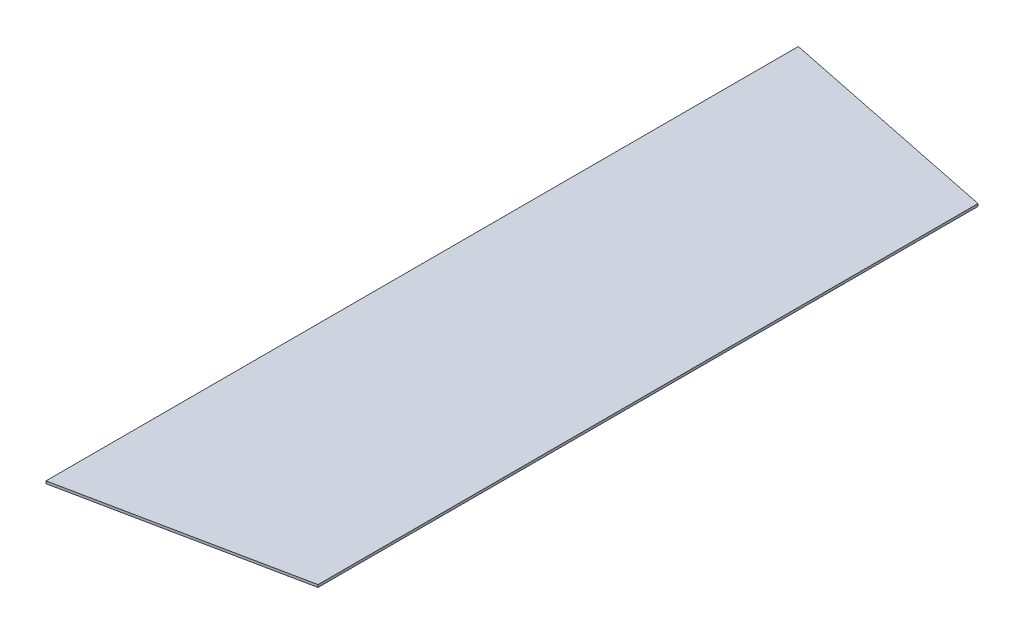
ISO-10303-21;
HEADER;
FILE_DESCRIPTION(('STEP AP214'),'2;1');
FILE_NAME('part.step','',(''),(''),'','','');
FILE_SCHEMA(('AUTOMOTIVE_DESIGN { 1 0 10303 214 1 1 1 1 }'));
ENDSEC;
DATA;
#1=APPLICATION_CONTEXT('core data for automotive mechanical design processes');
#2=APPLICATION_PROTOCOL_DEFINITION('international standard','automotive_design',2000,#1);
#3=PRODUCT_CONTEXT('',#1,'mechanical');
#4=PRODUCT('Part','Part','',(#3));
#5=PRODUCT_RELATED_PRODUCT_CATEGORY('part','',(#4));
#6=PRODUCT_DEFINITION_FORMATION('','',#4);
#7=PRODUCT_DEFINITION_CONTEXT('part definition',#1,'design');
#8=PRODUCT_DEFINITION('design','',#6,#7);
#9=PRODUCT_DEFINITION_SHAPE('','',#8);
#10=(LENGTH_UNIT() NAMED_UNIT(*) SI_UNIT(.MILLI.,.METRE.));
#11=(NAMED_UNIT(*) PLANE_ANGLE_UNIT() SI_UNIT($,.RADIAN.));
#12=(NAMED_UNIT(*) SI_UNIT($,.STERADIAN.) SOLID_ANGLE_UNIT());
#13=UNCERTAINTY_MEASURE_WITH_UNIT(LENGTH_MEASURE(1.E-05),#10,'distance_accuracy_value','');
#14=(GEOMETRIC_REPRESENTATION_CONTEXT(3) GLOBAL_UNCERTAINTY_ASSIGNED_CONTEXT((#13)) GLOBAL_UNIT_ASSIGNED_CONTEXT((#10,
#11,#12)) REPRESENTATION_CONTEXT('',''));
#15=CARTESIAN_POINT('',(0.,0.,0.));
#16=DIRECTION('',(0.,0.,1.));
#17=DIRECTION('',(1.,0.,0.));
#18=AXIS2_PLACEMENT_3D('',#15,#16,#17);
#19=CARTESIAN_POINT('',(0.600000000000001,0.,-1.49897790055249));
#20=DIRECTION('',(0.,1.,0.));
#21=DIRECTION('',(0.,0.,1.));
#22=AXIS2_PLACEMENT_3D('',#19,#20,#21);
#23=PLANE('',#22);
#24=DIRECTION('',(-0.979739078021312,0.,-0.200278154070655));
#25=VECTOR('',#24,1.);
#26=CARTESIAN_POINT('',(1.5,0.,-1.315));
#27=LINE('',#26,#25);
#28=CARTESIAN_POINT('',(1.5,0.,-1.315));
#29=VERTEX_POINT('',#28);
#30=CARTESIAN_POINT('',(0.600000000000001,0.,-1.49897790055249));
#31=VERTEX_POINT('',#30);
#32=EDGE_CURVE('E11',#29,#31,#27,.T.);
#33=ORIENTED_EDGE('',*,*,#32,.T.);
#34=DIRECTION('',(0.,0.,-1.));
#35=VECTOR('',#34,1.);
#36=CARTESIAN_POINT('',(0.600000000000001,0.,1.49897790055249));
#37=LINE('',#36,#35);
#38=CARTESIAN_POINT('',(0.600000000000001,0.,1.49897790055249));
#39=VERTEX_POINT('',#38);
#40=EDGE_CURVE('E61',#39,#31,#37,.T.);
#41=ORIENTED_EDGE('',*,*,#40,.F.);
#42=DIRECTION('',(0.979739078021312,0.,-0.200278154070655));
#43=VECTOR('',#42,1.);
#44=CARTESIAN_POINT('',(0.6,0.,1.49897790055249));
#45=LINE('',#44,#43);
#46=CARTESIAN_POINT('',(1.5,0.,1.315));
#47=VERTEX_POINT('',#46);
#48=EDGE_CURVE('E85',#39,#47,#45,.T.);
#49=ORIENTED_EDGE('',*,*,#48,.T.);
#50=DIRECTION('',(0.,0.,-1.));
#51=VECTOR('',#50,1.);
#52=CARTESIAN_POINT('',(1.5,0.,1.315));
#53=LINE('',#52,#51);
#54=EDGE_CURVE('E24',#47,#29,#53,.T.);
#55=ORIENTED_EDGE('',*,*,#54,.T.);
#56=EDGE_LOOP('',(#33,#41,#49,#55));
#57=FACE_BOUND('',#56,.T.);
#58=ADVANCED_FACE('F17',(#57),#23,.T.);
#59=CARTESIAN_POINT('',(1.5,0.29,1.315));
#60=DIRECTION('',(-1.,0.,0.));
#61=DIRECTION('',(0.,0.,1.));
#62=AXIS2_PLACEMENT_3D('',#59,#60,#61);
#63=PLANE('',#62);
#64=ORIENTED_EDGE('',*,*,#54,.F.);
#65=DIRECTION('',(0.,-1.,0.));
#66=VECTOR('',#65,1.);
#67=CARTESIAN_POINT('',(1.5,0.,1.315));
#68=LINE('',#67,#66);
#69=CARTESIAN_POINT('',(1.5,-0.01,1.315));
#70=VERTEX_POINT('',#69);
#71=EDGE_CURVE('E83',#47,#70,#68,.T.);
#72=ORIENTED_EDGE('',*,*,#71,.T.);
#73=DIRECTION('',(0.,0.,1.));
#74=VECTOR('',#73,1.);
#75=CARTESIAN_POINT('',(1.5,-0.01,-1.315));
#76=LINE('',#75,#74);
#77=CARTESIAN_POINT('',(1.5,-0.01,-1.315));
#78=VERTEX_POINT('',#77);
#79=EDGE_CURVE('E79',#78,#70,#76,.T.);
#80=ORIENTED_EDGE('',*,*,#79,.F.);
#81=DIRECTION('',(0.,-1.,0.));
#82=VECTOR('',#81,1.);
#83=CARTESIAN_POINT('',(1.5,0.,-1.315));
#84=LINE('',#83,#82);
#85=EDGE_CURVE('E68',#29,#78,#84,.T.);
#86=ORIENTED_EDGE('',*,*,#85,.F.);
#87=EDGE_LOOP('',(#64,#72,#80,#86));
#88=FACE_BOUND('',#87,.T.);
#89=ADVANCED_FACE('F89',(#88),#63,.F.);
#90=CARTESIAN_POINT('',(0.595,0.29,1.5));
#91=DIRECTION('',(-0.200278154070655,0.,-0.979739078021312));
#92=DIRECTION('',(-0.979739078021312,0.,0.200278154070655));
#93=AXIS2_PLACEMENT_3D('',#90,#91,#92);
#94=PLANE('',#93);
#95=ORIENTED_EDGE('',*,*,#48,.F.);
#96=DIRECTION('',(0.,1.,0.));
#97=VECTOR('',#96,1.);
#98=CARTESIAN_POINT('',(0.600000000000001,-0.01,1.49897790055249));
#99=LINE('',#98,#97);
#100=CARTESIAN_POINT('',(0.600000000000001,-0.01,1.49897790055249));
#101=VERTEX_POINT('',#100);
#102=EDGE_CURVE('E81',#101,#39,#99,.T.);
#103=ORIENTED_EDGE('',*,*,#102,.F.);
#104=DIRECTION('',(-0.979739078021312,0.,0.200278154070655));
#105=VECTOR('',#104,1.);
#106=CARTESIAN_POINT('',(1.5,-0.00999999999999999,1.315));
#107=LINE('',#106,#105);
#108=EDGE_CURVE('E71',#70,#101,#107,.T.);
#109=ORIENTED_EDGE('',*,*,#108,.F.);
#110=ORIENTED_EDGE('',*,*,#71,.F.);
#111=EDGE_LOOP('',(#95,#103,#109,#110));
#112=FACE_BOUND('',#111,.T.);
#113=ADVANCED_FACE('F91',(#112),#94,.F.);
#114=CARTESIAN_POINT('',(1.5,0.29,-1.315));
#115=DIRECTION('',(-0.200278154070655,0.,0.979739078021312));
#116=DIRECTION('',(0.979739078021312,0.,0.200278154070655));
#117=AXIS2_PLACEMENT_3D('',#114,#115,#116);
#118=PLANE('',#117);
#119=ORIENTED_EDGE('',*,*,#32,.F.);
#120=ORIENTED_EDGE('',*,*,#85,.T.);
#121=DIRECTION('',(0.979739078021312,0.,0.200278154070654));
#122=VECTOR('',#121,1.);
#123=CARTESIAN_POINT('',(0.599999999999999,-0.00999999999999999,-1.49897790055248));
#124=LINE('',#123,#122);
#125=CARTESIAN_POINT('',(0.600000000000001,-0.01,-1.49897790055249));
#126=VERTEX_POINT('',#125);
#127=EDGE_CURVE('E63',#126,#78,#124,.T.);
#128=ORIENTED_EDGE('',*,*,#127,.F.);
#129=DIRECTION('',(0.,1.,0.));
#130=VECTOR('',#129,1.);
#131=CARTESIAN_POINT('',(0.600000000000001,-0.01,-1.49897790055249));
#132=LINE('',#131,#130);
#133=EDGE_CURVE('E54',#126,#31,#132,.T.);
#134=ORIENTED_EDGE('',*,*,#133,.T.);
#135=EDGE_LOOP('',(#119,#120,#128,#134));
#136=FACE_BOUND('',#135,.T.);
#137=ADVANCED_FACE('F67',(#136),#118,.F.);
#138=CARTESIAN_POINT('',(0.600000000000001,-0.01,-1.49897790055249));
#139=DIRECTION('',(1.,0.,0.));
#140=DIRECTION('',(0.,0.,-1.));
#141=AXIS2_PLACEMENT_3D('',#138,#139,#140);
#142=PLANE('',#141);
#143=ORIENTED_EDGE('',*,*,#40,.T.);
#144=ORIENTED_EDGE('',*,*,#133,.F.);
#145=DIRECTION('',(0.,0.,-1.));
#146=VECTOR('',#145,1.);
#147=CARTESIAN_POINT('',(0.600000000000001,-0.01,1.49897790055249));
#148=LINE('',#147,#146);
#149=EDGE_CURVE('E59',#101,#126,#148,.T.);
#150=ORIENTED_EDGE('',*,*,#149,.F.);
#151=ORIENTED_EDGE('',*,*,#102,.T.);
#152=EDGE_LOOP('',(#143,#144,#150,#151));
#153=FACE_BOUND('',#152,.T.);
#154=ADVANCED_FACE('F56',(#153),#142,.F.);
#155=CARTESIAN_POINT('',(0.,-0.01,0.));
#156=DIRECTION('',(0.,-1.,0.));
#157=DIRECTION('',(0.,0.,-1.));
#158=AXIS2_PLACEMENT_3D('',#155,#156,#157);
#159=PLANE('',#158);
#160=ORIENTED_EDGE('',*,*,#127,.T.);
#161=ORIENTED_EDGE('',*,*,#79,.T.);
#162=ORIENTED_EDGE('',*,*,#108,.T.);
#163=ORIENTED_EDGE('',*,*,#149,.T.);
#164=EDGE_LOOP('',(#160,#161,#162,#163));
#165=FACE_BOUND('',#164,.T.);
#166=ADVANCED_FACE('F73',(#165),#159,.T.);
#167=CLOSED_SHELL('',(#58,#89,#113,#137,#154,#166));
#168=MANIFOLD_SOLID_BREP('B1',#167);
#169=ADVANCED_BREP_SHAPE_REPRESENTATION('',(#18,#168),#14);
#170=SHAPE_DEFINITION_REPRESENTATION(#9,#169);
ENDSEC;
END-ISO-10303-21;
